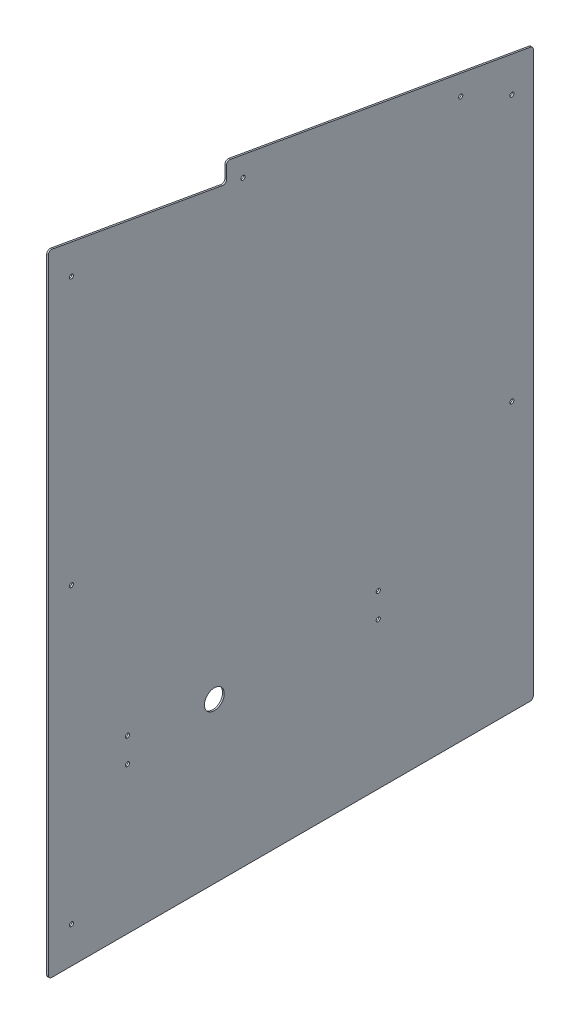
ISO-10303-21;
HEADER;
FILE_DESCRIPTION(('STEP AP214'),'2;1');
FILE_NAME('part.step','',(''),(''),'','','');
FILE_SCHEMA(('AUTOMOTIVE_DESIGN { 1 0 10303 214 1 1 1 1 }'));
ENDSEC;
DATA;
#1=APPLICATION_CONTEXT('core data for automotive mechanical design processes');
#2=APPLICATION_PROTOCOL_DEFINITION('international standard','automotive_design',2000,#1);
#3=PRODUCT_CONTEXT('',#1,'mechanical');
#4=PRODUCT('Part','Part','',(#3));
#5=PRODUCT_RELATED_PRODUCT_CATEGORY('part','',(#4));
#6=PRODUCT_DEFINITION_FORMATION('','',#4);
#7=PRODUCT_DEFINITION_CONTEXT('part definition',#1,'design');
#8=PRODUCT_DEFINITION('design','',#6,#7);
#9=PRODUCT_DEFINITION_SHAPE('','',#8);
#10=(LENGTH_UNIT() NAMED_UNIT(*) SI_UNIT(.MILLI.,.METRE.));
#11=(NAMED_UNIT(*) PLANE_ANGLE_UNIT() SI_UNIT($,.RADIAN.));
#12=(NAMED_UNIT(*) SI_UNIT($,.STERADIAN.) SOLID_ANGLE_UNIT());
#13=UNCERTAINTY_MEASURE_WITH_UNIT(LENGTH_MEASURE(1.E-05),#10,'distance_accuracy_value','');
#14=(GEOMETRIC_REPRESENTATION_CONTEXT(3) GLOBAL_UNCERTAINTY_ASSIGNED_CONTEXT((#13)) GLOBAL_UNIT_ASSIGNED_CONTEXT((#10,
#11,#12)) REPRESENTATION_CONTEXT('',''));
#15=CARTESIAN_POINT('',(0.,0.,0.));
#16=DIRECTION('',(0.,0.,1.));
#17=DIRECTION('',(1.,0.,0.));
#18=AXIS2_PLACEMENT_3D('',#15,#16,#17);
#19=CARTESIAN_POINT('',(3.175,1214.92966622947,0.));
#20=DIRECTION('',(0.,0.,-1.));
#21=DIRECTION('',(0.,1.,0.));
#22=AXIS2_PLACEMENT_3D('',#19,#20,#21);
#23=PLANE('',#22);
#24=DIRECTION('',(0.,-1.,0.));
#25=VECTOR('',#24,1.);
#26=CARTESIAN_POINT('',(0.,1214.92966622947,0.));
#27=LINE('',#26,#25);
#28=CARTESIAN_POINT('',(0.,1207.36203091649,0.));
#29=VERTEX_POINT('',#28);
#30=CARTESIAN_POINT('',(0.,6.35000000000008,0.));
#31=VERTEX_POINT('',#30);
#32=EDGE_CURVE('E156',#29,#31,#27,.T.);
#33=ORIENTED_EDGE('',*,*,#32,.T.);
#34=DIRECTION('',(-1.,0.,0.));
#35=VECTOR('',#34,1.);
#36=CARTESIAN_POINT('',(3.175,6.35000000000008,0.));
#37=LINE('',#36,#35);
#38=CARTESIAN_POINT('',(3.175,6.35000000000008,0.));
#39=VERTEX_POINT('',#38);
#40=EDGE_CURVE('E188',#31,#39,#37,.F.);
#41=ORIENTED_EDGE('',*,*,#40,.T.);
#42=DIRECTION('',(0.,-1.,0.));
#43=VECTOR('',#42,1.);
#44=CARTESIAN_POINT('',(3.175,1214.92966622947,0.));
#45=LINE('',#44,#43);
#46=CARTESIAN_POINT('',(3.175,1207.36203091649,0.));
#47=VERTEX_POINT('',#46);
#48=EDGE_CURVE('E164',#47,#39,#45,.T.);
#49=ORIENTED_EDGE('',*,*,#48,.F.);
#50=DIRECTION('',(-1.,0.,0.));
#51=VECTOR('',#50,1.);
#52=CARTESIAN_POINT('',(3.175,1207.36203091649,0.));
#53=LINE('',#52,#51);
#54=EDGE_CURVE('E185',#47,#29,#53,.T.);
#55=ORIENTED_EDGE('',*,*,#54,.T.);
#56=EDGE_LOOP('',(#33,#41,#49,#55));
#57=FACE_BOUND('',#56,.T.);
#58=ADVANCED_FACE('F34',(#57),#23,.F.);
#59=CARTESIAN_POINT('',(3.175,0.,0.));
#60=DIRECTION('',(0.,1.,0.));
#61=DIRECTION('',(0.,0.,1.));
#62=AXIS2_PLACEMENT_3D('',#59,#60,#61);
#63=PLANE('',#62);
#64=DIRECTION('',(0.,0.,-1.));
#65=VECTOR('',#64,1.);
#66=CARTESIAN_POINT('',(0.,0.,0.));
#67=LINE('',#66,#65);
#68=CARTESIAN_POINT('',(0.,0.,-6.35));
#69=VERTEX_POINT('',#68);
#70=CARTESIAN_POINT('',(0.,0.,-927.1));
#71=VERTEX_POINT('',#70);
#72=EDGE_CURVE('E151',#69,#71,#67,.T.);
#73=ORIENTED_EDGE('',*,*,#72,.T.);
#74=DIRECTION('',(-1.,0.,0.));
#75=VECTOR('',#74,1.);
#76=CARTESIAN_POINT('',(3.175,0.,-927.1));
#77=LINE('',#76,#75);
#78=CARTESIAN_POINT('',(3.175,0.,-927.1));
#79=VERTEX_POINT('',#78);
#80=EDGE_CURVE('E128',#71,#79,#77,.F.);
#81=ORIENTED_EDGE('',*,*,#80,.T.);
#82=DIRECTION('',(0.,0.,-1.));
#83=VECTOR('',#82,1.);
#84=CARTESIAN_POINT('',(3.175,0.,0.));
#85=LINE('',#84,#83);
#86=CARTESIAN_POINT('',(3.175,0.,-6.35));
#87=VERTEX_POINT('',#86);
#88=EDGE_CURVE('E238',#87,#79,#85,.T.);
#89=ORIENTED_EDGE('',*,*,#88,.F.);
#90=DIRECTION('',(-1.,0.,0.));
#91=VECTOR('',#90,1.);
#92=CARTESIAN_POINT('',(3.175,0.,-6.35));
#93=LINE('',#92,#91);
#94=EDGE_CURVE('E133',#87,#69,#93,.T.);
#95=ORIENTED_EDGE('',*,*,#94,.T.);
#96=EDGE_LOOP('',(#73,#81,#89,#95));
#97=FACE_BOUND('',#96,.T.);
#98=ADVANCED_FACE('F258',(#97),#63,.F.);
#99=CARTESIAN_POINT('',(3.175,0.,-933.45));
#100=DIRECTION('',(0.,0.,1.));
#101=DIRECTION('',(1.,0.,0.));
#102=AXIS2_PLACEMENT_3D('',#99,#100,#101);
#103=PLANE('',#102);
#104=DIRECTION('',(0.,1.,0.));
#105=VECTOR('',#104,1.);
#106=CARTESIAN_POINT('',(3.175,0.,-933.45));
#107=LINE('',#106,#105);
#108=CARTESIAN_POINT('',(3.175,6.35,-933.45));
#109=VERTEX_POINT('',#108);
#110=CARTESIAN_POINT('',(3.175,1083.69671734202,-933.45));
#111=VERTEX_POINT('',#110);
#112=EDGE_CURVE('E143',#109,#111,#107,.T.);
#113=ORIENTED_EDGE('',*,*,#112,.F.);
#114=DIRECTION('',(-1.,0.,0.));
#115=VECTOR('',#114,1.);
#116=CARTESIAN_POINT('',(3.175,6.35,-933.45));
#117=LINE('',#116,#115);
#118=CARTESIAN_POINT('',(0.,6.35,-933.45));
#119=VERTEX_POINT('',#118);
#120=EDGE_CURVE('E127',#109,#119,#117,.T.);
#121=ORIENTED_EDGE('',*,*,#120,.T.);
#122=DIRECTION('',(0.,1.,0.));
#123=VECTOR('',#122,1.);
#124=CARTESIAN_POINT('',(0.,0.,-933.45));
#125=LINE('',#124,#123);
#126=CARTESIAN_POINT('',(0.,1083.69671734202,-933.45));
#127=VERTEX_POINT('',#126);
#128=EDGE_CURVE('E140',#119,#127,#125,.T.);
#129=ORIENTED_EDGE('',*,*,#128,.T.);
#130=DIRECTION('',(-1.,0.,0.));
#131=VECTOR('',#130,1.);
#132=CARTESIAN_POINT('',(3.175,1083.69671734202,-933.45));
#133=LINE('',#132,#131);
#134=EDGE_CURVE('E145',#127,#111,#133,.F.);
#135=ORIENTED_EDGE('',*,*,#134,.T.);
#136=EDGE_LOOP('',(#113,#121,#129,#135));
#137=FACE_BOUND('',#136,.T.);
#138=ADVANCED_FACE('F139',(#137),#103,.F.);
#139=CARTESIAN_POINT('',(3.175,1089.025,-933.45));
#140=DIRECTION('',(0.,-0.984807753012209,0.173648177666926));
#141=DIRECTION('',(0.,-0.173648177666926,-0.984807753012209));
#142=AXIS2_PLACEMENT_3D('',#139,#140,#141);
#143=PLANE('',#142);
#144=DIRECTION('',(0.,0.173648177666926,0.984807753012209));
#145=VECTOR('',#144,1.);
#146=CARTESIAN_POINT('',(3.175,1089.025,-933.45));
#147=LINE('',#146,#145);
#148=CARTESIAN_POINT('',(3.175,1089.95024657365,-928.202665928185));
#149=VERTEX_POINT('',#148);
#150=CARTESIAN_POINT('',(3.175,1191.84079237604,-350.352665928185));
#151=VERTEX_POINT('',#150);
#152=EDGE_CURVE('E217',#149,#151,#147,.T.);
#153=ORIENTED_EDGE('',*,*,#152,.F.);
#154=DIRECTION('',(-1.,0.,0.));
#155=VECTOR('',#154,1.);
#156=CARTESIAN_POINT('',(3.175,1089.95024657365,-928.202665928185));
#157=LINE('',#156,#155);
#158=CARTESIAN_POINT('',(0.,1089.95024657365,-928.202665928185));
#159=VERTEX_POINT('',#158);
#160=EDGE_CURVE('E192',#149,#159,#157,.T.);
#161=ORIENTED_EDGE('',*,*,#160,.T.);
#162=DIRECTION('',(0.,0.173648177666926,0.984807753012209));
#163=VECTOR('',#162,1.);
#164=CARTESIAN_POINT('',(0.,1089.025,-933.45));
#165=LINE('',#164,#163);
#166=CARTESIAN_POINT('',(0.,1191.84079237604,-350.352665928185));
#167=VERTEX_POINT('',#166);
#168=EDGE_CURVE('E150',#159,#167,#165,.T.);
#169=ORIENTED_EDGE('',*,*,#168,.T.);
#170=DIRECTION('',(-1.,0.,0.));
#171=VECTOR('',#170,1.);
#172=CARTESIAN_POINT('',(3.175,1191.84079237604,-350.352665928185));
#173=LINE('',#172,#171);
#174=EDGE_CURVE('E190',#167,#151,#173,.F.);
#175=ORIENTED_EDGE('',*,*,#174,.T.);
#176=EDGE_LOOP('',(#153,#161,#169,#175));
#177=FACE_BOUND('',#176,.T.);
#178=ADVANCED_FACE('F251',(#177),#143,.F.);
#179=CARTESIAN_POINT('',(3.175,1193.15489845738,-342.9));
#180=DIRECTION('',(0.,0.,-1.));
#181=DIRECTION('',(-1.,0.,0.));
#182=AXIS2_PLACEMENT_3D('',#179,#180,#181);
#183=PLANE('',#182);
#184=DIRECTION('',(0.,-1.,0.));
#185=VECTOR('',#184,1.);
#186=CARTESIAN_POINT('',(3.175,1193.15489845738,-342.9));
#187=LINE('',#186,#185);
#188=CARTESIAN_POINT('',(3.175,1185.58726314441,-342.9));
#189=VERTEX_POINT('',#188);
#190=CARTESIAN_POINT('',(3.175,1162.03477985751,-342.9));
#191=VERTEX_POINT('',#190);
#192=EDGE_CURVE('E215',#189,#191,#187,.T.);
#193=ORIENTED_EDGE('',*,*,#192,.F.);
#194=DIRECTION('',(-1.,0.,0.));
#195=VECTOR('',#194,1.);
#196=CARTESIAN_POINT('',(3.175,1185.58726314441,-342.9));
#197=LINE('',#196,#195);
#198=CARTESIAN_POINT('',(0.,1185.58726314441,-342.9));
#199=VERTEX_POINT('',#198);
#200=EDGE_CURVE('E197',#189,#199,#197,.T.);
#201=ORIENTED_EDGE('',*,*,#200,.T.);
#202=DIRECTION('',(0.,-1.,0.));
#203=VECTOR('',#202,1.);
#204=CARTESIAN_POINT('',(0.,1193.15489845738,-342.9));
#205=LINE('',#204,#203);
#206=CARTESIAN_POINT('',(0.,1162.03477985751,-342.9));
#207=VERTEX_POINT('',#206);
#208=EDGE_CURVE('E154',#199,#207,#205,.T.);
#209=ORIENTED_EDGE('',*,*,#208,.T.);
#210=DIRECTION('',(-1.,0.,0.));
#211=VECTOR('',#210,1.);
#212=CARTESIAN_POINT('',(3.175,1162.03477985751,-342.9));
#213=LINE('',#212,#211);
#214=EDGE_CURVE('E195',#207,#191,#213,.F.);
#215=ORIENTED_EDGE('',*,*,#214,.T.);
#216=EDGE_LOOP('',(#193,#201,#209,#215));
#217=FACE_BOUND('',#216,.T.);
#218=ADVANCED_FACE('F210',(#217),#183,.F.);
#219=CARTESIAN_POINT('',(3.175,1154.46714454453,-342.9));
#220=DIRECTION('',(0.,-0.984807753012209,0.173648177666927));
#221=DIRECTION('',(0.,-0.173648177666927,-0.984807753012209));
#222=AXIS2_PLACEMENT_3D('',#219,#220,#221);
#223=PLANE('',#222);
#224=DIRECTION('',(0.,0.173648177666927,0.984807753012209));
#225=VECTOR('',#224,1.);
#226=CARTESIAN_POINT('',(3.175,1154.46714454453,-342.9));
#227=LINE('',#226,#225);
#228=CARTESIAN_POINT('',(3.175,1155.78125062588,-335.447334071815));
#229=VERTEX_POINT('',#228);
#230=CARTESIAN_POINT('',(3.175,1213.61556014812,-7.45266592818505));
#231=VERTEX_POINT('',#230);
#232=EDGE_CURVE('E165',#229,#231,#227,.T.);
#233=ORIENTED_EDGE('',*,*,#232,.F.);
#234=DIRECTION('',(-1.,0.,0.));
#235=VECTOR('',#234,1.);
#236=CARTESIAN_POINT('',(0.,1155.78125062588,-335.447334071815));
#237=LINE('',#236,#235);
#238=CARTESIAN_POINT('',(0.,1155.78125062588,-335.447334071815));
#239=VERTEX_POINT('',#238);
#240=EDGE_CURVE('E201',#229,#239,#237,.T.);
#241=ORIENTED_EDGE('',*,*,#240,.T.);
#242=DIRECTION('',(0.,0.173648177666927,0.984807753012209));
#243=VECTOR('',#242,1.);
#244=CARTESIAN_POINT('',(0.,1154.46714454453,-342.9));
#245=LINE('',#244,#243);
#246=CARTESIAN_POINT('',(0.,1213.61556014812,-7.45266592818505));
#247=VERTEX_POINT('',#246);
#248=EDGE_CURVE('E162',#239,#247,#245,.T.);
#249=ORIENTED_EDGE('',*,*,#248,.T.);
#250=DIRECTION('',(-1.,0.,0.));
#251=VECTOR('',#250,1.);
#252=CARTESIAN_POINT('',(3.175,1213.61556014812,-7.452665928185));
#253=LINE('',#252,#251);
#254=EDGE_CURVE('E49',#247,#231,#253,.F.);
#255=ORIENTED_EDGE('',*,*,#254,.T.);
#256=EDGE_LOOP('',(#233,#241,#249,#255));
#257=FACE_BOUND('',#256,.T.);
#258=ADVANCED_FACE('F213',(#257),#223,.F.);
#259=CARTESIAN_POINT('',(3.175,0.,0.));
#260=DIRECTION('',(1.,0.,0.));
#261=DIRECTION('',(0.,0.,-1.));
#262=AXIS2_PLACEMENT_3D('',#259,#260,#261);
#263=PLANE('',#262);
#264=CARTESIAN_POINT('',(3.175,1149.35,-44.45));
#265=DIRECTION('',(1.,0.,0.));
#266=DIRECTION('',(0.,0.,-1.));
#267=AXIS2_PLACEMENT_3D('',#264,#265,#266);
#268=CIRCLE('',#267,3.96875000000008);
#269=CARTESIAN_POINT('',(3.175,1149.35,-48.4187500000001));
#270=VERTEX_POINT('',#269);
#271=EDGE_CURVE('E476',#270,#270,#268,.T.);
#272=ORIENTED_EDGE('',*,*,#271,.F.);
#273=EDGE_LOOP('',(#272));
#274=FACE_BOUND('',#273,.T.);
#275=CARTESIAN_POINT('',(3.175,635.,-44.45));
#276=DIRECTION('',(1.,0.,0.));
#277=DIRECTION('',(0.,0.,-1.));
#278=AXIS2_PLACEMENT_3D('',#275,#276,#277);
#279=CIRCLE('',#278,3.96874999999997);
#280=CARTESIAN_POINT('',(3.175,635.,-48.41875));
#281=VERTEX_POINT('',#280);
#282=EDGE_CURVE('E478',#281,#281,#279,.T.);
#283=ORIENTED_EDGE('',*,*,#282,.F.);
#284=EDGE_LOOP('',(#283));
#285=FACE_BOUND('',#284,.T.);
#286=CARTESIAN_POINT('',(3.175,330.2,-152.4));
#287=DIRECTION('',(1.,0.,0.));
#288=DIRECTION('',(0.,0.,-1.));
#289=AXIS2_PLACEMENT_3D('',#286,#287,#288);
#290=CIRCLE('',#289,3.96874999999997);
#291=CARTESIAN_POINT('',(3.175,330.2,-156.36875));
#292=VERTEX_POINT('',#291);
#293=EDGE_CURVE('E486',#292,#292,#290,.T.);
#294=ORIENTED_EDGE('',*,*,#293,.F.);
#295=EDGE_LOOP('',(#294));
#296=FACE_BOUND('',#295,.T.);
#297=CARTESIAN_POINT('',(3.175,282.575,-152.4));
#298=DIRECTION('',(1.,0.,0.));
#299=DIRECTION('',(0.,0.,-1.));
#300=AXIS2_PLACEMENT_3D('',#297,#298,#299);
#301=CIRCLE('',#300,3.96874999999997);
#302=CARTESIAN_POINT('',(3.175,282.575,-156.36875));
#303=VERTEX_POINT('',#302);
#304=EDGE_CURVE('E492',#303,#303,#301,.T.);
#305=ORIENTED_EDGE('',*,*,#304,.F.);
#306=EDGE_LOOP('',(#305));
#307=FACE_BOUND('',#306,.T.);
#308=CARTESIAN_POINT('',(3.175,330.2,-635.));
#309=DIRECTION('',(1.,0.,0.));
#310=DIRECTION('',(0.,0.,-1.));
#311=AXIS2_PLACEMENT_3D('',#308,#309,#310);
#312=CIRCLE('',#311,3.96874999999997);
#313=CARTESIAN_POINT('',(3.175,330.2,-638.96875));
#314=VERTEX_POINT('',#313);
#315=EDGE_CURVE('E498',#314,#314,#312,.T.);
#316=ORIENTED_EDGE('',*,*,#315,.F.);
#317=EDGE_LOOP('',(#316));
#318=FACE_BOUND('',#317,.T.);
#319=CARTESIAN_POINT('',(3.175,282.575,-635.));
#320=DIRECTION('',(1.,0.,0.));
#321=DIRECTION('',(0.,0.,-1.));
#322=AXIS2_PLACEMENT_3D('',#319,#320,#321);
#323=CIRCLE('',#322,3.96874999999997);
#324=CARTESIAN_POINT('',(3.175,282.575,-638.96875));
#325=VERTEX_POINT('',#324);
#326=EDGE_CURVE('E504',#325,#325,#323,.T.);
#327=ORIENTED_EDGE('',*,*,#326,.F.);
#328=EDGE_LOOP('',(#327));
#329=FACE_BOUND('',#328,.T.);
#330=CARTESIAN_POINT('',(3.175,517.525,-892.175));
#331=DIRECTION('',(1.,0.,0.));
#332=DIRECTION('',(0.,0.,-1.));
#333=AXIS2_PLACEMENT_3D('',#330,#331,#332);
#334=CIRCLE('',#333,3.96874999999997);
#335=CARTESIAN_POINT('',(3.175,517.525,-896.14375));
#336=VERTEX_POINT('',#335);
#337=EDGE_CURVE('E510',#336,#336,#334,.T.);
#338=ORIENTED_EDGE('',*,*,#337,.F.);
#339=EDGE_LOOP('',(#338));
#340=FACE_BOUND('',#339,.T.);
#341=CARTESIAN_POINT('',(3.175,1028.7,-892.175));
#342=DIRECTION('',(1.,0.,0.));
#343=DIRECTION('',(0.,0.,-1.));
#344=AXIS2_PLACEMENT_3D('',#341,#342,#343);
#345=CIRCLE('',#344,3.96875000000008);
#346=CARTESIAN_POINT('',(3.175,1028.7,-896.14375));
#347=VERTEX_POINT('',#346);
#348=EDGE_CURVE('E516',#347,#347,#345,.T.);
#349=ORIENTED_EDGE('',*,*,#348,.F.);
#350=EDGE_LOOP('',(#349));
#351=FACE_BOUND('',#350,.T.);
#352=CARTESIAN_POINT('',(3.175,1148.86876290704,-374.65));
#353=DIRECTION('',(1.,0.,0.));
#354=DIRECTION('',(0.,0.,-1.));
#355=AXIS2_PLACEMENT_3D('',#352,#353,#354);
#356=CIRCLE('',#355,3.96875000000008);
#357=CARTESIAN_POINT('',(3.175,1148.86876290704,-378.61875));
#358=VERTEX_POINT('',#357);
#359=EDGE_CURVE('E522',#358,#358,#356,.T.);
#360=ORIENTED_EDGE('',*,*,#359,.F.);
#361=EDGE_LOOP('',(#360));
#362=FACE_BOUND('',#361,.T.);
#363=CARTESIAN_POINT('',(3.175,1074.97012529213,-793.75));
#364=DIRECTION('',(1.,0.,0.));
#365=DIRECTION('',(0.,0.,-1.));
#366=AXIS2_PLACEMENT_3D('',#363,#364,#365);
#367=CIRCLE('',#366,3.96875000000008);
#368=CARTESIAN_POINT('',(3.175,1074.97012529213,-797.71875));
#369=VERTEX_POINT('',#368);
#370=EDGE_CURVE('E528',#369,#369,#367,.T.);
#371=ORIENTED_EDGE('',*,*,#370,.F.);
#372=EDGE_LOOP('',(#371));
#373=FACE_BOUND('',#372,.T.);
#374=CARTESIAN_POINT('',(3.175,69.85,-44.45));
#375=DIRECTION('',(1.,0.,0.));
#376=DIRECTION('',(0.,0.,-1.));
#377=AXIS2_PLACEMENT_3D('',#374,#375,#376);
#378=CIRCLE('',#377,3.96874999999999);
#379=CARTESIAN_POINT('',(3.175,69.85,-48.41875));
#380=VERTEX_POINT('',#379);
#381=EDGE_CURVE('E533',#380,#380,#378,.T.);
#382=ORIENTED_EDGE('',*,*,#381,.F.);
#383=EDGE_LOOP('',(#382));
#384=FACE_BOUND('',#383,.T.);
#385=CARTESIAN_POINT('',(3.175,307.34,-319.532));
#386=DIRECTION('',(1.,0.,0.));
#387=DIRECTION('',(0.,0.,-1.));
#388=AXIS2_PLACEMENT_3D('',#385,#386,#387);
#389=CIRCLE('',#388,19.05);
#390=CARTESIAN_POINT('',(3.175,307.34,-338.582));
#391=VERTEX_POINT('',#390);
#392=EDGE_CURVE('E226',#391,#391,#389,.T.);
#393=ORIENTED_EDGE('',*,*,#392,.F.);
#394=EDGE_LOOP('',(#393));
#395=FACE_BOUND('',#394,.T.);
#396=ORIENTED_EDGE('',*,*,#88,.T.);
#397=CARTESIAN_POINT('',(3.175,6.35,-927.1));
#398=DIRECTION('',(1.,0.,0.));
#399=DIRECTION('',(0.,0.,-1.));
#400=AXIS2_PLACEMENT_3D('',#397,#398,#399);
#401=CIRCLE('',#400,6.35);
#402=EDGE_CURVE('E183',#79,#109,#401,.T.);
#403=ORIENTED_EDGE('',*,*,#402,.T.);
#404=ORIENTED_EDGE('',*,*,#112,.T.);
#405=CARTESIAN_POINT('',(3.175,1083.69671734202,-927.1));
#406=DIRECTION('',(1.,0.,0.));
#407=DIRECTION('',(0.,0.,-1.));
#408=AXIS2_PLACEMENT_3D('',#405,#406,#407);
#409=CIRCLE('',#408,6.35);
#410=EDGE_CURVE('E179',#111,#149,#409,.T.);
#411=ORIENTED_EDGE('',*,*,#410,.T.);
#412=ORIENTED_EDGE('',*,*,#152,.T.);
#413=CARTESIAN_POINT('',(3.175,1185.58726314441,-349.25));
#414=DIRECTION('',(1.,0.,0.));
#415=DIRECTION('',(0.,0.,-1.));
#416=AXIS2_PLACEMENT_3D('',#413,#414,#415);
#417=CIRCLE('',#416,6.35);
#418=EDGE_CURVE('E177',#151,#189,#417,.T.);
#419=ORIENTED_EDGE('',*,*,#418,.T.);
#420=ORIENTED_EDGE('',*,*,#192,.T.);
#421=CARTESIAN_POINT('',(3.175,1162.03477985751,-336.55));
#422=DIRECTION('',(1.,0.,0.));
#423=DIRECTION('',(0.,0.,-1.));
#424=AXIS2_PLACEMENT_3D('',#421,#422,#423);
#425=CIRCLE('',#424,6.35);
#426=EDGE_CURVE('E11',#191,#229,#425,.F.);
#427=ORIENTED_EDGE('',*,*,#426,.T.);
#428=ORIENTED_EDGE('',*,*,#232,.T.);
#429=CARTESIAN_POINT('',(3.175,1207.36203091649,-6.35));
#430=DIRECTION('',(1.,0.,0.));
#431=DIRECTION('',(0.,0.,-1.));
#432=AXIS2_PLACEMENT_3D('',#429,#430,#431);
#433=CIRCLE('',#432,6.35);
#434=EDGE_CURVE('E175',#231,#47,#433,.T.);
#435=ORIENTED_EDGE('',*,*,#434,.T.);
#436=ORIENTED_EDGE('',*,*,#48,.T.);
#437=CARTESIAN_POINT('',(3.175,6.35,-6.35));
#438=DIRECTION('',(1.,0.,0.));
#439=DIRECTION('',(0.,0.,-1.));
#440=AXIS2_PLACEMENT_3D('',#437,#438,#439);
#441=CIRCLE('',#440,6.35);
#442=EDGE_CURVE('E181',#39,#87,#441,.T.);
#443=ORIENTED_EDGE('',*,*,#442,.T.);
#444=EDGE_LOOP('',(#396,#403,#404,#411,#412,#419,#420,#427,#428,#435,#436,#443));
#445=FACE_BOUND('',#444,.T.);
#446=ADVANCED_FACE('F244',(#274,#285,#296,#307,#318,#329,#340,#351,#362,#373,#384,#395,#445),
#263,.T.);
#447=CARTESIAN_POINT('',(0.,0.,0.));
#448=DIRECTION('',(1.,0.,0.));
#449=DIRECTION('',(0.,0.,-1.));
#450=AXIS2_PLACEMENT_3D('',#447,#448,#449);
#451=PLANE('',#450);
#452=CARTESIAN_POINT('',(0.,1149.35,-44.45));
#453=DIRECTION('',(1.,0.,0.));
#454=DIRECTION('',(0.,0.,-1.));
#455=AXIS2_PLACEMENT_3D('',#452,#453,#454);
#456=CIRCLE('',#455,3.96875000000008);
#457=CARTESIAN_POINT('',(0.,1149.35,-48.4187500000001));
#458=VERTEX_POINT('',#457);
#459=EDGE_CURVE('E473',#458,#458,#456,.T.);
#460=ORIENTED_EDGE('',*,*,#459,.T.);
#461=EDGE_LOOP('',(#460));
#462=FACE_BOUND('',#461,.T.);
#463=CARTESIAN_POINT('',(0.,635.,-44.45));
#464=DIRECTION('',(1.,0.,0.));
#465=DIRECTION('',(0.,0.,-1.));
#466=AXIS2_PLACEMENT_3D('',#463,#464,#465);
#467=CIRCLE('',#466,3.96874999999997);
#468=CARTESIAN_POINT('',(0.,635.,-48.41875));
#469=VERTEX_POINT('',#468);
#470=EDGE_CURVE('E483',#469,#469,#467,.T.);
#471=ORIENTED_EDGE('',*,*,#470,.T.);
#472=EDGE_LOOP('',(#471));
#473=FACE_BOUND('',#472,.T.);
#474=CARTESIAN_POINT('',(0.,330.2,-152.4));
#475=DIRECTION('',(1.,0.,0.));
#476=DIRECTION('',(0.,0.,-1.));
#477=AXIS2_PLACEMENT_3D('',#474,#475,#476);
#478=CIRCLE('',#477,3.96875000000002);
#479=CARTESIAN_POINT('',(0.,330.2,-156.36875));
#480=VERTEX_POINT('',#479);
#481=EDGE_CURVE('E489',#480,#480,#478,.T.);
#482=ORIENTED_EDGE('',*,*,#481,.T.);
#483=EDGE_LOOP('',(#482));
#484=FACE_BOUND('',#483,.T.);
#485=CARTESIAN_POINT('',(0.,282.575,-152.4));
#486=DIRECTION('',(1.,0.,0.));
#487=DIRECTION('',(0.,0.,-1.));
#488=AXIS2_PLACEMENT_3D('',#485,#486,#487);
#489=CIRCLE('',#488,3.96875000000002);
#490=CARTESIAN_POINT('',(0.,282.575,-156.36875));
#491=VERTEX_POINT('',#490);
#492=EDGE_CURVE('E495',#491,#491,#489,.T.);
#493=ORIENTED_EDGE('',*,*,#492,.T.);
#494=EDGE_LOOP('',(#493));
#495=FACE_BOUND('',#494,.T.);
#496=CARTESIAN_POINT('',(0.,330.2,-635.));
#497=DIRECTION('',(1.,0.,0.));
#498=DIRECTION('',(0.,0.,-1.));
#499=AXIS2_PLACEMENT_3D('',#496,#497,#498);
#500=CIRCLE('',#499,3.96875000000002);
#501=CARTESIAN_POINT('',(0.,330.2,-638.96875));
#502=VERTEX_POINT('',#501);
#503=EDGE_CURVE('E501',#502,#502,#500,.T.);
#504=ORIENTED_EDGE('',*,*,#503,.T.);
#505=EDGE_LOOP('',(#504));
#506=FACE_BOUND('',#505,.T.);
#507=CARTESIAN_POINT('',(0.,282.575,-635.));
#508=DIRECTION('',(1.,0.,0.));
#509=DIRECTION('',(0.,0.,-1.));
#510=AXIS2_PLACEMENT_3D('',#507,#508,#509);
#511=CIRCLE('',#510,3.96875000000002);
#512=CARTESIAN_POINT('',(0.,282.575,-638.96875));
#513=VERTEX_POINT('',#512);
#514=EDGE_CURVE('E507',#513,#513,#511,.T.);
#515=ORIENTED_EDGE('',*,*,#514,.T.);
#516=EDGE_LOOP('',(#515));
#517=FACE_BOUND('',#516,.T.);
#518=CARTESIAN_POINT('',(0.,517.525,-892.175));
#519=DIRECTION('',(1.,0.,0.));
#520=DIRECTION('',(0.,0.,-1.));
#521=AXIS2_PLACEMENT_3D('',#518,#519,#520);
#522=CIRCLE('',#521,3.96874999999997);
#523=CARTESIAN_POINT('',(0.,517.525,-896.14375));
#524=VERTEX_POINT('',#523);
#525=EDGE_CURVE('E513',#524,#524,#522,.T.);
#526=ORIENTED_EDGE('',*,*,#525,.T.);
#527=EDGE_LOOP('',(#526));
#528=FACE_BOUND('',#527,.T.);
#529=CARTESIAN_POINT('',(0.,1028.7,-892.175));
#530=DIRECTION('',(1.,0.,0.));
#531=DIRECTION('',(0.,0.,-1.));
#532=AXIS2_PLACEMENT_3D('',#529,#530,#531);
#533=CIRCLE('',#532,3.96875000000008);
#534=CARTESIAN_POINT('',(0.,1028.7,-896.14375));
#535=VERTEX_POINT('',#534);
#536=EDGE_CURVE('E519',#535,#535,#533,.T.);
#537=ORIENTED_EDGE('',*,*,#536,.T.);
#538=EDGE_LOOP('',(#537));
#539=FACE_BOUND('',#538,.T.);
#540=CARTESIAN_POINT('',(0.,1148.86876290704,-374.65));
#541=DIRECTION('',(1.,0.,0.));
#542=DIRECTION('',(0.,0.,-1.));
#543=AXIS2_PLACEMENT_3D('',#540,#541,#542);
#544=CIRCLE('',#543,3.96875000000008);
#545=CARTESIAN_POINT('',(0.,1148.86876290704,-378.61875));
#546=VERTEX_POINT('',#545);
#547=EDGE_CURVE('E525',#546,#546,#544,.T.);
#548=ORIENTED_EDGE('',*,*,#547,.T.);
#549=EDGE_LOOP('',(#548));
#550=FACE_BOUND('',#549,.T.);
#551=CARTESIAN_POINT('',(0.,1074.97012529213,-793.75));
#552=DIRECTION('',(1.,0.,0.));
#553=DIRECTION('',(0.,0.,-1.));
#554=AXIS2_PLACEMENT_3D('',#551,#552,#553);
#555=CIRCLE('',#554,3.96875000000008);
#556=CARTESIAN_POINT('',(0.,1074.97012529213,-797.71875));
#557=VERTEX_POINT('',#556);
#558=EDGE_CURVE('E531',#557,#557,#555,.T.);
#559=ORIENTED_EDGE('',*,*,#558,.T.);
#560=EDGE_LOOP('',(#559));
#561=FACE_BOUND('',#560,.T.);
#562=CARTESIAN_POINT('',(0.,69.85,-44.45));
#563=DIRECTION('',(1.,0.,0.));
#564=DIRECTION('',(0.,0.,-1.));
#565=AXIS2_PLACEMENT_3D('',#562,#563,#564);
#566=CIRCLE('',#565,3.96874999999999);
#567=CARTESIAN_POINT('',(0.,69.85,-48.41875));
#568=VERTEX_POINT('',#567);
#569=EDGE_CURVE('E231',#568,#568,#566,.T.);
#570=ORIENTED_EDGE('',*,*,#569,.T.);
#571=EDGE_LOOP('',(#570));
#572=FACE_BOUND('',#571,.T.);
#573=CARTESIAN_POINT('',(0.,307.34,-319.532));
#574=DIRECTION('',(1.,0.,0.));
#575=DIRECTION('',(0.,0.,-1.));
#576=AXIS2_PLACEMENT_3D('',#573,#574,#575);
#577=CIRCLE('',#576,19.05);
#578=CARTESIAN_POINT('',(0.,307.34,-338.582));
#579=VERTEX_POINT('',#578);
#580=EDGE_CURVE('E221',#579,#579,#577,.T.);
#581=ORIENTED_EDGE('',*,*,#580,.T.);
#582=EDGE_LOOP('',(#581));
#583=FACE_BOUND('',#582,.T.);
#584=ORIENTED_EDGE('',*,*,#128,.F.);
#585=CARTESIAN_POINT('',(0.,6.35,-927.1));
#586=DIRECTION('',(1.,0.,0.));
#587=DIRECTION('',(0.,0.,-1.));
#588=AXIS2_PLACEMENT_3D('',#585,#586,#587);
#589=CIRCLE('',#588,6.35);
#590=EDGE_CURVE('E123',#119,#71,#589,.F.);
#591=ORIENTED_EDGE('',*,*,#590,.T.);
#592=ORIENTED_EDGE('',*,*,#72,.F.);
#593=CARTESIAN_POINT('',(0.,6.35,-6.35));
#594=DIRECTION('',(1.,0.,0.));
#595=DIRECTION('',(0.,0.,-1.));
#596=AXIS2_PLACEMENT_3D('',#593,#594,#595);
#597=CIRCLE('',#596,6.35);
#598=EDGE_CURVE('E134',#69,#31,#597,.F.);
#599=ORIENTED_EDGE('',*,*,#598,.T.);
#600=ORIENTED_EDGE('',*,*,#32,.F.);
#601=CARTESIAN_POINT('',(0.,1207.36203091649,-6.35));
#602=DIRECTION('',(1.,0.,0.));
#603=DIRECTION('',(0.,0.,-1.));
#604=AXIS2_PLACEMENT_3D('',#601,#602,#603);
#605=CIRCLE('',#604,6.35);
#606=EDGE_CURVE('E144',#29,#247,#605,.F.);
#607=ORIENTED_EDGE('',*,*,#606,.T.);
#608=ORIENTED_EDGE('',*,*,#248,.F.);
#609=CARTESIAN_POINT('',(0.,1162.03477985751,-336.55));
#610=DIRECTION('',(1.,0.,0.));
#611=DIRECTION('',(0.,0.,-1.));
#612=AXIS2_PLACEMENT_3D('',#609,#610,#611);
#613=CIRCLE('',#612,6.35);
#614=EDGE_CURVE('E42',#239,#207,#613,.T.);
#615=ORIENTED_EDGE('',*,*,#614,.T.);
#616=ORIENTED_EDGE('',*,*,#208,.F.);
#617=CARTESIAN_POINT('',(0.,1185.58726314441,-349.25));
#618=DIRECTION('',(1.,0.,0.));
#619=DIRECTION('',(0.,0.,-1.));
#620=AXIS2_PLACEMENT_3D('',#617,#618,#619);
#621=CIRCLE('',#620,6.35);
#622=EDGE_CURVE('E168',#199,#167,#621,.F.);
#623=ORIENTED_EDGE('',*,*,#622,.T.);
#624=ORIENTED_EDGE('',*,*,#168,.F.);
#625=CARTESIAN_POINT('',(0.,1083.69671734202,-927.1));
#626=DIRECTION('',(1.,0.,0.));
#627=DIRECTION('',(0.,0.,-1.));
#628=AXIS2_PLACEMENT_3D('',#625,#626,#627);
#629=CIRCLE('',#628,6.35);
#630=EDGE_CURVE('E149',#159,#127,#629,.F.);
#631=ORIENTED_EDGE('',*,*,#630,.T.);
#632=EDGE_LOOP('',(#584,#591,#592,#599,#600,#607,#608,#615,#616,#623,#624,#631));
#633=FACE_BOUND('',#632,.T.);
#634=ADVANCED_FACE('F147',(#462,#473,#484,#495,#506,#517,#528,#539,#550,#561,#572,#583,#633),
#451,.F.);
#635=CARTESIAN_POINT('',(0.,307.34,-319.532));
#636=DIRECTION('',(1.,0.,0.));
#637=DIRECTION('',(0.,0.,-1.));
#638=AXIS2_PLACEMENT_3D('',#635,#636,#637);
#639=CYLINDRICAL_SURFACE('',#638,19.05);
#640=ORIENTED_EDGE('',*,*,#580,.F.);
#641=EDGE_LOOP('',(#640));
#642=FACE_BOUND('',#641,.T.);
#643=ORIENTED_EDGE('',*,*,#392,.T.);
#644=EDGE_LOOP('',(#643));
#645=FACE_BOUND('',#644,.T.);
#646=ADVANCED_FACE('F274',(#642,#645),#639,.F.);
#647=CARTESIAN_POINT('',(3.175,6.35,-927.1));
#648=DIRECTION('',(-1.,0.,0.));
#649=DIRECTION('',(0.,0.,1.));
#650=AXIS2_PLACEMENT_3D('',#647,#648,#649);
#651=CYLINDRICAL_SURFACE('',#650,6.35);
#652=ORIENTED_EDGE('',*,*,#402,.F.);
#653=ORIENTED_EDGE('',*,*,#80,.F.);
#654=ORIENTED_EDGE('',*,*,#590,.F.);
#655=ORIENTED_EDGE('',*,*,#120,.F.);
#656=EDGE_LOOP('',(#652,#653,#654,#655));
#657=FACE_BOUND('',#656,.T.);
#658=ADVANCED_FACE('F126',(#657),#651,.T.);
#659=CARTESIAN_POINT('',(3.175,6.35,-6.35));
#660=DIRECTION('',(-1.,0.,0.));
#661=DIRECTION('',(0.,0.,1.));
#662=AXIS2_PLACEMENT_3D('',#659,#660,#661);
#663=CYLINDRICAL_SURFACE('',#662,6.35);
#664=ORIENTED_EDGE('',*,*,#442,.F.);
#665=ORIENTED_EDGE('',*,*,#40,.F.);
#666=ORIENTED_EDGE('',*,*,#598,.F.);
#667=ORIENTED_EDGE('',*,*,#94,.F.);
#668=EDGE_LOOP('',(#664,#665,#666,#667));
#669=FACE_BOUND('',#668,.T.);
#670=ADVANCED_FACE('F260',(#669),#663,.T.);
#671=CARTESIAN_POINT('',(3.175,1083.69671734202,-927.1));
#672=DIRECTION('',(-1.,0.,0.));
#673=DIRECTION('',(0.,0.,1.));
#674=AXIS2_PLACEMENT_3D('',#671,#672,#673);
#675=CYLINDRICAL_SURFACE('',#674,6.35);
#676=ORIENTED_EDGE('',*,*,#410,.F.);
#677=ORIENTED_EDGE('',*,*,#134,.F.);
#678=ORIENTED_EDGE('',*,*,#630,.F.);
#679=ORIENTED_EDGE('',*,*,#160,.F.);
#680=EDGE_LOOP('',(#676,#677,#678,#679));
#681=FACE_BOUND('',#680,.T.);
#682=ADVANCED_FACE('F253',(#681),#675,.T.);
#683=CARTESIAN_POINT('',(3.175,1185.58726314441,-349.25));
#684=DIRECTION('',(-1.,0.,0.));
#685=DIRECTION('',(0.,0.,1.));
#686=AXIS2_PLACEMENT_3D('',#683,#684,#685);
#687=CYLINDRICAL_SURFACE('',#686,6.35);
#688=ORIENTED_EDGE('',*,*,#418,.F.);
#689=ORIENTED_EDGE('',*,*,#174,.F.);
#690=ORIENTED_EDGE('',*,*,#622,.F.);
#691=ORIENTED_EDGE('',*,*,#200,.F.);
#692=EDGE_LOOP('',(#688,#689,#690,#691));
#693=FACE_BOUND('',#692,.T.);
#694=ADVANCED_FACE('F250',(#693),#687,.T.);
#695=CARTESIAN_POINT('',(3.175,1162.03477985751,-336.55));
#696=DIRECTION('',(1.,0.,0.));
#697=DIRECTION('',(0.,0.,-1.));
#698=AXIS2_PLACEMENT_3D('',#695,#696,#697);
#699=CYLINDRICAL_SURFACE('',#698,6.35);
#700=ORIENTED_EDGE('',*,*,#426,.F.);
#701=ORIENTED_EDGE('',*,*,#214,.F.);
#702=ORIENTED_EDGE('',*,*,#614,.F.);
#703=ORIENTED_EDGE('',*,*,#240,.F.);
#704=EDGE_LOOP('',(#700,#701,#702,#703));
#705=FACE_BOUND('',#704,.T.);
#706=ADVANCED_FACE('F212',(#705),#699,.F.);
#707=CARTESIAN_POINT('',(3.175,1207.36203091649,-6.35));
#708=DIRECTION('',(-1.,0.,0.));
#709=DIRECTION('',(0.,0.,1.));
#710=AXIS2_PLACEMENT_3D('',#707,#708,#709);
#711=CYLINDRICAL_SURFACE('',#710,6.35);
#712=ORIENTED_EDGE('',*,*,#434,.F.);
#713=ORIENTED_EDGE('',*,*,#254,.F.);
#714=ORIENTED_EDGE('',*,*,#606,.F.);
#715=ORIENTED_EDGE('',*,*,#54,.F.);
#716=EDGE_LOOP('',(#712,#713,#714,#715));
#717=FACE_BOUND('',#716,.T.);
#718=ADVANCED_FACE('F36',(#717),#711,.T.);
#719=CARTESIAN_POINT('',(3.175,69.85,-44.45));
#720=DIRECTION('',(1.,0.,0.));
#721=DIRECTION('',(0.,0.,-1.));
#722=AXIS2_PLACEMENT_3D('',#719,#720,#721);
#723=CYLINDRICAL_SURFACE('',#722,3.96874999999999);
#724=ORIENTED_EDGE('',*,*,#569,.F.);
#725=EDGE_LOOP('',(#724));
#726=FACE_BOUND('',#725,.T.);
#727=ORIENTED_EDGE('',*,*,#381,.T.);
#728=EDGE_LOOP('',(#727));
#729=FACE_BOUND('',#728,.T.);
#730=ADVANCED_FACE('F284',(#726,#729),#723,.F.);
#731=CARTESIAN_POINT('',(3.175,1074.97012529213,-793.75));
#732=DIRECTION('',(1.,0.,0.));
#733=DIRECTION('',(0.,0.,-1.));
#734=AXIS2_PLACEMENT_3D('',#731,#732,#733);
#735=CYLINDRICAL_SURFACE('',#734,3.96875000000008);
#736=ORIENTED_EDGE('',*,*,#558,.F.);
#737=EDGE_LOOP('',(#736));
#738=FACE_BOUND('',#737,.T.);
#739=ORIENTED_EDGE('',*,*,#370,.T.);
#740=EDGE_LOOP('',(#739));
#741=FACE_BOUND('',#740,.T.);
#742=ADVANCED_FACE('F288',(#738,#741),#735,.F.);
#743=CARTESIAN_POINT('',(3.175,1148.86876290704,-374.65));
#744=DIRECTION('',(1.,0.,0.));
#745=DIRECTION('',(0.,0.,-1.));
#746=AXIS2_PLACEMENT_3D('',#743,#744,#745);
#747=CYLINDRICAL_SURFACE('',#746,3.96875000000008);
#748=ORIENTED_EDGE('',*,*,#547,.F.);
#749=EDGE_LOOP('',(#748));
#750=FACE_BOUND('',#749,.T.);
#751=ORIENTED_EDGE('',*,*,#359,.T.);
#752=EDGE_LOOP('',(#751));
#753=FACE_BOUND('',#752,.T.);
#754=ADVANCED_FACE('F294',(#750,#753),#747,.F.);
#755=CARTESIAN_POINT('',(3.175,1028.7,-892.175));
#756=DIRECTION('',(1.,0.,0.));
#757=DIRECTION('',(0.,0.,-1.));
#758=AXIS2_PLACEMENT_3D('',#755,#756,#757);
#759=CYLINDRICAL_SURFACE('',#758,3.96875000000008);
#760=ORIENTED_EDGE('',*,*,#536,.F.);
#761=EDGE_LOOP('',(#760));
#762=FACE_BOUND('',#761,.T.);
#763=ORIENTED_EDGE('',*,*,#348,.T.);
#764=EDGE_LOOP('',(#763));
#765=FACE_BOUND('',#764,.T.);
#766=ADVANCED_FACE('F387',(#762,#765),#759,.F.);
#767=CARTESIAN_POINT('',(3.175,517.525,-892.175));
#768=DIRECTION('',(1.,0.,0.));
#769=DIRECTION('',(0.,0.,-1.));
#770=AXIS2_PLACEMENT_3D('',#767,#768,#769);
#771=CYLINDRICAL_SURFACE('',#770,3.96874999999997);
#772=ORIENTED_EDGE('',*,*,#525,.F.);
#773=EDGE_LOOP('',(#772));
#774=FACE_BOUND('',#773,.T.);
#775=ORIENTED_EDGE('',*,*,#337,.T.);
#776=EDGE_LOOP('',(#775));
#777=FACE_BOUND('',#776,.T.);
#778=ADVANCED_FACE('F395',(#774,#777),#771,.F.);
#779=CARTESIAN_POINT('',(3.175,282.575,-635.));
#780=DIRECTION('',(1.,0.,0.));
#781=DIRECTION('',(0.,0.,-1.));
#782=AXIS2_PLACEMENT_3D('',#779,#780,#781);
#783=CYLINDRICAL_SURFACE('',#782,3.96874999999999);
#784=ORIENTED_EDGE('',*,*,#514,.F.);
#785=EDGE_LOOP('',(#784));
#786=FACE_BOUND('',#785,.T.);
#787=ORIENTED_EDGE('',*,*,#326,.T.);
#788=EDGE_LOOP('',(#787));
#789=FACE_BOUND('',#788,.T.);
#790=ADVANCED_FACE('F404',(#786,#789),#783,.F.);
#791=CARTESIAN_POINT('',(3.175,330.2,-635.));
#792=DIRECTION('',(1.,0.,0.));
#793=DIRECTION('',(0.,0.,-1.));
#794=AXIS2_PLACEMENT_3D('',#791,#792,#793);
#795=CYLINDRICAL_SURFACE('',#794,3.96874999999999);
#796=ORIENTED_EDGE('',*,*,#503,.F.);
#797=EDGE_LOOP('',(#796));
#798=FACE_BOUND('',#797,.T.);
#799=ORIENTED_EDGE('',*,*,#315,.T.);
#800=EDGE_LOOP('',(#799));
#801=FACE_BOUND('',#800,.T.);
#802=ADVANCED_FACE('F413',(#798,#801),#795,.F.);
#803=CARTESIAN_POINT('',(3.175,282.575,-152.4));
#804=DIRECTION('',(1.,0.,0.));
#805=DIRECTION('',(0.,0.,-1.));
#806=AXIS2_PLACEMENT_3D('',#803,#804,#805);
#807=CYLINDRICAL_SURFACE('',#806,3.96874999999999);
#808=ORIENTED_EDGE('',*,*,#492,.F.);
#809=EDGE_LOOP('',(#808));
#810=FACE_BOUND('',#809,.T.);
#811=ORIENTED_EDGE('',*,*,#304,.T.);
#812=EDGE_LOOP('',(#811));
#813=FACE_BOUND('',#812,.T.);
#814=ADVANCED_FACE('F422',(#810,#813),#807,.F.);
#815=CARTESIAN_POINT('',(3.175,330.2,-152.4));
#816=DIRECTION('',(1.,0.,0.));
#817=DIRECTION('',(0.,0.,-1.));
#818=AXIS2_PLACEMENT_3D('',#815,#816,#817);
#819=CYLINDRICAL_SURFACE('',#818,3.96874999999999);
#820=ORIENTED_EDGE('',*,*,#481,.F.);
#821=EDGE_LOOP('',(#820));
#822=FACE_BOUND('',#821,.T.);
#823=ORIENTED_EDGE('',*,*,#293,.T.);
#824=EDGE_LOOP('',(#823));
#825=FACE_BOUND('',#824,.T.);
#826=ADVANCED_FACE('F431',(#822,#825),#819,.F.);
#827=CARTESIAN_POINT('',(3.175,635.,-44.45));
#828=DIRECTION('',(1.,0.,0.));
#829=DIRECTION('',(0.,0.,-1.));
#830=AXIS2_PLACEMENT_3D('',#827,#828,#829);
#831=CYLINDRICAL_SURFACE('',#830,3.96874999999997);
#832=ORIENTED_EDGE('',*,*,#470,.F.);
#833=EDGE_LOOP('',(#832));
#834=FACE_BOUND('',#833,.T.);
#835=ORIENTED_EDGE('',*,*,#282,.T.);
#836=EDGE_LOOP('',(#835));
#837=FACE_BOUND('',#836,.T.);
#838=ADVANCED_FACE('F440',(#834,#837),#831,.F.);
#839=CARTESIAN_POINT('',(3.175,1149.35,-44.45));
#840=DIRECTION('',(1.,0.,0.));
#841=DIRECTION('',(0.,0.,-1.));
#842=AXIS2_PLACEMENT_3D('',#839,#840,#841);
#843=CYLINDRICAL_SURFACE('',#842,3.96875000000008);
#844=ORIENTED_EDGE('',*,*,#459,.F.);
#845=EDGE_LOOP('',(#844));
#846=FACE_BOUND('',#845,.T.);
#847=ORIENTED_EDGE('',*,*,#271,.T.);
#848=EDGE_LOOP('',(#847));
#849=FACE_BOUND('',#848,.T.);
#850=ADVANCED_FACE('F449',(#846,#849),#843,.F.);
#851=CLOSED_SHELL('',(#58,#98,#138,#178,#218,#258,#446,#634,#646,#658,#670,#682,#694,#706,#718,
#730,#742,#754,#766,#778,#790,#802,#814,#826,#838,#850));
#852=MANIFOLD_SOLID_BREP('B2',#851);
#853=ADVANCED_BREP_SHAPE_REPRESENTATION('',(#18,#852),#14);
#854=SHAPE_DEFINITION_REPRESENTATION(#9,#853);
ENDSEC;
END-ISO-10303-21;
